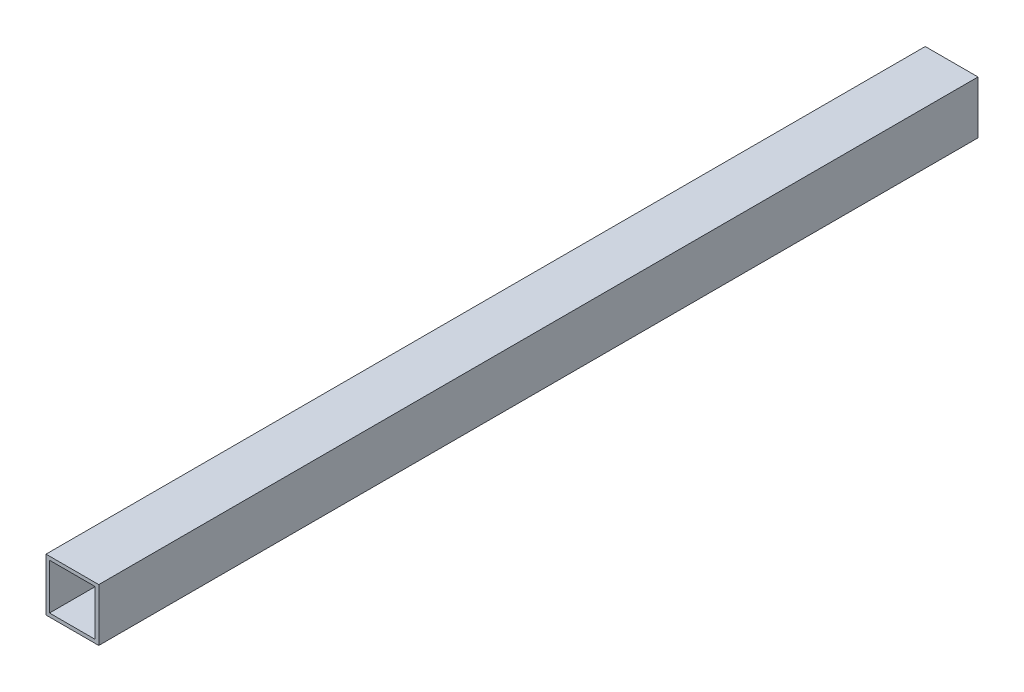
ISO-10303-21;
HEADER;
FILE_DESCRIPTION(('STEP AP214'),'2;1');
FILE_NAME('part.step','',(''),(''),'','','');
FILE_SCHEMA(('AUTOMOTIVE_DESIGN { 1 0 10303 214 1 1 1 1 }'));
ENDSEC;
DATA;
#1=APPLICATION_CONTEXT('core data for automotive mechanical design processes');
#2=APPLICATION_PROTOCOL_DEFINITION('international standard','automotive_design',2000,#1);
#3=PRODUCT_CONTEXT('',#1,'mechanical');
#4=PRODUCT('Part','Part','',(#3));
#5=PRODUCT_RELATED_PRODUCT_CATEGORY('part','',(#4));
#6=PRODUCT_DEFINITION_FORMATION('','',#4);
#7=PRODUCT_DEFINITION_CONTEXT('part definition',#1,'design');
#8=PRODUCT_DEFINITION('design','',#6,#7);
#9=PRODUCT_DEFINITION_SHAPE('','',#8);
#10=(LENGTH_UNIT() NAMED_UNIT(*) SI_UNIT(.MILLI.,.METRE.));
#11=(NAMED_UNIT(*) PLANE_ANGLE_UNIT() SI_UNIT($,.RADIAN.));
#12=(NAMED_UNIT(*) SI_UNIT($,.STERADIAN.) SOLID_ANGLE_UNIT());
#13=UNCERTAINTY_MEASURE_WITH_UNIT(LENGTH_MEASURE(1.E-05),#10,'distance_accuracy_value','');
#14=(GEOMETRIC_REPRESENTATION_CONTEXT(3) GLOBAL_UNCERTAINTY_ASSIGNED_CONTEXT((#13)) GLOBAL_UNIT_ASSIGNED_CONTEXT((#10,
#11,#12)) REPRESENTATION_CONTEXT('',''));
#15=CARTESIAN_POINT('',(0.,0.,0.));
#16=DIRECTION('',(0.,0.,1.));
#17=DIRECTION('',(1.,0.,0.));
#18=AXIS2_PLACEMENT_3D('',#15,#16,#17);
#19=CARTESIAN_POINT('',(0.,0.,250.));
#20=DIRECTION('',(0.,0.,1.));
#21=DIRECTION('',(1.,0.,0.));
#22=AXIS2_PLACEMENT_3D('',#19,#20,#21);
#23=PLANE('',#22);
#24=DIRECTION('',(0.,-1.,0.));
#25=VECTOR('',#24,1.);
#26=CARTESIAN_POINT('',(0.,0.,250.));
#27=LINE('',#26,#25);
#28=CARTESIAN_POINT('',(0.,15.,250.));
#29=VERTEX_POINT('',#28);
#30=CARTESIAN_POINT('',(0.,0.,250.));
#31=VERTEX_POINT('',#30);
#32=EDGE_CURVE('E164',#29,#31,#27,.T.);
#33=ORIENTED_EDGE('',*,*,#32,.T.);
#34=DIRECTION('',(1.,0.,0.));
#35=VECTOR('',#34,1.);
#36=CARTESIAN_POINT('',(0.,0.,250.));
#37=LINE('',#36,#35);
#38=CARTESIAN_POINT('',(15.,0.,250.));
#39=VERTEX_POINT('',#38);
#40=EDGE_CURVE('E167',#31,#39,#37,.T.);
#41=ORIENTED_EDGE('',*,*,#40,.T.);
#42=DIRECTION('',(0.,1.,0.));
#43=VECTOR('',#42,1.);
#44=CARTESIAN_POINT('',(15.,0.,250.));
#45=LINE('',#44,#43);
#46=CARTESIAN_POINT('',(15.,15.,250.));
#47=VERTEX_POINT('',#46);
#48=EDGE_CURVE('E170',#39,#47,#45,.T.);
#49=ORIENTED_EDGE('',*,*,#48,.T.);
#50=DIRECTION('',(-1.,0.,0.));
#51=VECTOR('',#50,1.);
#52=CARTESIAN_POINT('',(0.,15.,250.));
#53=LINE('',#52,#51);
#54=EDGE_CURVE('E172',#47,#29,#53,.T.);
#55=ORIENTED_EDGE('',*,*,#54,.T.);
#56=EDGE_LOOP('',(#33,#41,#49,#55));
#57=FACE_BOUND('',#56,.T.);
#58=DIRECTION('',(1.,0.,0.));
#59=VECTOR('',#58,1.);
#60=CARTESIAN_POINT('',(0.,1.,250.));
#61=LINE('',#60,#59);
#62=CARTESIAN_POINT('',(1.,1.,250.));
#63=VERTEX_POINT('',#62);
#64=CARTESIAN_POINT('',(14.,1.,250.));
#65=VERTEX_POINT('',#64);
#66=EDGE_CURVE('E136',#63,#65,#61,.T.);
#67=ORIENTED_EDGE('',*,*,#66,.F.);
#68=DIRECTION('',(0.,-1.,0.));
#69=VECTOR('',#68,1.);
#70=CARTESIAN_POINT('',(1.,0.,250.));
#71=LINE('',#70,#69);
#72=CARTESIAN_POINT('',(0.999999999999998,14.,250.));
#73=VERTEX_POINT('',#72);
#74=EDGE_CURVE('E128',#73,#63,#71,.T.);
#75=ORIENTED_EDGE('',*,*,#74,.F.);
#76=DIRECTION('',(-1.,0.,0.));
#77=VECTOR('',#76,1.);
#78=CARTESIAN_POINT('',(0.,14.,250.));
#79=LINE('',#78,#77);
#80=CARTESIAN_POINT('',(14.,14.,250.));
#81=VERTEX_POINT('',#80);
#82=EDGE_CURVE('E150',#81,#73,#79,.T.);
#83=ORIENTED_EDGE('',*,*,#82,.F.);
#84=DIRECTION('',(0.,1.,0.));
#85=VECTOR('',#84,1.);
#86=CARTESIAN_POINT('',(14.,0.,250.));
#87=LINE('',#86,#85);
#88=EDGE_CURVE('E148',#65,#81,#87,.T.);
#89=ORIENTED_EDGE('',*,*,#88,.F.);
#90=EDGE_LOOP('',(#67,#75,#83,#89));
#91=FACE_BOUND('',#90,.T.);
#92=ADVANCED_FACE('F63',(#57,#91),#23,.T.);
#93=CARTESIAN_POINT('',(0.,0.,0.));
#94=DIRECTION('',(0.,0.,1.));
#95=DIRECTION('',(1.,0.,0.));
#96=AXIS2_PLACEMENT_3D('',#93,#94,#95);
#97=PLANE('',#96);
#98=DIRECTION('',(0.,-1.,0.));
#99=VECTOR('',#98,1.);
#100=CARTESIAN_POINT('',(0.,0.,0.));
#101=LINE('',#100,#99);
#102=CARTESIAN_POINT('',(0.,15.,0.));
#103=VERTEX_POINT('',#102);
#104=CARTESIAN_POINT('',(0.,0.,0.));
#105=VERTEX_POINT('',#104);
#106=EDGE_CURVE('E144',#103,#105,#101,.T.);
#107=ORIENTED_EDGE('',*,*,#106,.F.);
#108=DIRECTION('',(-1.,0.,0.));
#109=VECTOR('',#108,1.);
#110=CARTESIAN_POINT('',(0.,15.,0.));
#111=LINE('',#110,#109);
#112=CARTESIAN_POINT('',(15.,15.,0.));
#113=VERTEX_POINT('',#112);
#114=EDGE_CURVE('E168',#113,#103,#111,.T.);
#115=ORIENTED_EDGE('',*,*,#114,.F.);
#116=DIRECTION('',(0.,1.,0.));
#117=VECTOR('',#116,1.);
#118=CARTESIAN_POINT('',(15.,0.,0.));
#119=LINE('',#118,#117);
#120=CARTESIAN_POINT('',(15.,0.,0.));
#121=VERTEX_POINT('',#120);
#122=EDGE_CURVE('E179',#121,#113,#119,.T.);
#123=ORIENTED_EDGE('',*,*,#122,.F.);
#124=DIRECTION('',(1.,0.,0.));
#125=VECTOR('',#124,1.);
#126=CARTESIAN_POINT('',(0.,0.,0.));
#127=LINE('',#126,#125);
#128=EDGE_CURVE('E177',#105,#121,#127,.T.);
#129=ORIENTED_EDGE('',*,*,#128,.F.);
#130=EDGE_LOOP('',(#107,#115,#123,#129));
#131=FACE_BOUND('',#130,.T.);
#132=DIRECTION('',(0.,-1.,0.));
#133=VECTOR('',#132,1.);
#134=CARTESIAN_POINT('',(1.,0.,0.));
#135=LINE('',#134,#133);
#136=CARTESIAN_POINT('',(0.999999999999998,14.,0.));
#137=VERTEX_POINT('',#136);
#138=CARTESIAN_POINT('',(1.,1.,0.));
#139=VERTEX_POINT('',#138);
#140=EDGE_CURVE('E86',#137,#139,#135,.T.);
#141=ORIENTED_EDGE('',*,*,#140,.T.);
#142=DIRECTION('',(1.,0.,0.));
#143=VECTOR('',#142,1.);
#144=CARTESIAN_POINT('',(0.,1.,0.));
#145=LINE('',#144,#143);
#146=CARTESIAN_POINT('',(14.,1.,0.));
#147=VERTEX_POINT('',#146);
#148=EDGE_CURVE('E143',#139,#147,#145,.T.);
#149=ORIENTED_EDGE('',*,*,#148,.T.);
#150=DIRECTION('',(0.,1.,0.));
#151=VECTOR('',#150,1.);
#152=CARTESIAN_POINT('',(14.,0.,0.));
#153=LINE('',#152,#151);
#154=CARTESIAN_POINT('',(14.,14.,0.));
#155=VERTEX_POINT('',#154);
#156=EDGE_CURVE('E156',#147,#155,#153,.T.);
#157=ORIENTED_EDGE('',*,*,#156,.T.);
#158=DIRECTION('',(-1.,0.,0.));
#159=VECTOR('',#158,1.);
#160=CARTESIAN_POINT('',(0.,14.,0.));
#161=LINE('',#160,#159);
#162=EDGE_CURVE('E137',#155,#137,#161,.T.);
#163=ORIENTED_EDGE('',*,*,#162,.T.);
#164=EDGE_LOOP('',(#141,#149,#157,#163));
#165=FACE_BOUND('',#164,.T.);
#166=ADVANCED_FACE('F197',(#131,#165),#97,.F.);
#167=CARTESIAN_POINT('',(0.,0.,250.));
#168=DIRECTION('',(1.,0.,0.));
#169=DIRECTION('',(0.,1.,0.));
#170=AXIS2_PLACEMENT_3D('',#167,#168,#169);
#171=PLANE('',#170);
#172=ORIENTED_EDGE('',*,*,#106,.T.);
#173=DIRECTION('',(0.,0.,-1.));
#174=VECTOR('',#173,1.);
#175=CARTESIAN_POINT('',(0.,0.,250.));
#176=LINE('',#175,#174);
#177=EDGE_CURVE('E12',#31,#105,#176,.T.);
#178=ORIENTED_EDGE('',*,*,#177,.F.);
#179=ORIENTED_EDGE('',*,*,#32,.F.);
#180=DIRECTION('',(0.,0.,-1.));
#181=VECTOR('',#180,1.);
#182=CARTESIAN_POINT('',(0.,15.,250.));
#183=LINE('',#182,#181);
#184=EDGE_CURVE('E174',#29,#103,#183,.T.);
#185=ORIENTED_EDGE('',*,*,#184,.T.);
#186=EDGE_LOOP('',(#172,#178,#179,#185));
#187=FACE_BOUND('',#186,.T.);
#188=ADVANCED_FACE('F65',(#187),#171,.F.);
#189=CARTESIAN_POINT('',(0.,0.,250.));
#190=DIRECTION('',(0.,1.,0.));
#191=DIRECTION('',(0.,0.,1.));
#192=AXIS2_PLACEMENT_3D('',#189,#190,#191);
#193=PLANE('',#192);
#194=ORIENTED_EDGE('',*,*,#128,.T.);
#195=DIRECTION('',(0.,0.,-1.));
#196=VECTOR('',#195,1.);
#197=CARTESIAN_POINT('',(15.,0.,250.));
#198=LINE('',#197,#196);
#199=EDGE_CURVE('E71',#39,#121,#198,.T.);
#200=ORIENTED_EDGE('',*,*,#199,.F.);
#201=ORIENTED_EDGE('',*,*,#40,.F.);
#202=ORIENTED_EDGE('',*,*,#177,.T.);
#203=EDGE_LOOP('',(#194,#200,#201,#202));
#204=FACE_BOUND('',#203,.T.);
#205=ADVANCED_FACE('F207',(#204),#193,.F.);
#206=CARTESIAN_POINT('',(15.,0.,250.));
#207=DIRECTION('',(-1.,0.,0.));
#208=DIRECTION('',(0.,-1.,0.));
#209=AXIS2_PLACEMENT_3D('',#206,#207,#208);
#210=PLANE('',#209);
#211=ORIENTED_EDGE('',*,*,#122,.T.);
#212=DIRECTION('',(0.,0.,-1.));
#213=VECTOR('',#212,1.);
#214=CARTESIAN_POINT('',(15.,15.,250.));
#215=LINE('',#214,#213);
#216=EDGE_CURVE('E184',#47,#113,#215,.T.);
#217=ORIENTED_EDGE('',*,*,#216,.F.);
#218=ORIENTED_EDGE('',*,*,#48,.F.);
#219=ORIENTED_EDGE('',*,*,#199,.T.);
#220=EDGE_LOOP('',(#211,#217,#218,#219));
#221=FACE_BOUND('',#220,.T.);
#222=ADVANCED_FACE('F191',(#221),#210,.F.);
#223=CARTESIAN_POINT('',(0.,15.,250.));
#224=DIRECTION('',(0.,-1.,0.));
#225=DIRECTION('',(0.,0.,-1.));
#226=AXIS2_PLACEMENT_3D('',#223,#224,#225);
#227=PLANE('',#226);
#228=ORIENTED_EDGE('',*,*,#114,.T.);
#229=ORIENTED_EDGE('',*,*,#184,.F.);
#230=ORIENTED_EDGE('',*,*,#54,.F.);
#231=ORIENTED_EDGE('',*,*,#216,.T.);
#232=EDGE_LOOP('',(#228,#229,#230,#231));
#233=FACE_BOUND('',#232,.T.);
#234=ADVANCED_FACE('F201',(#233),#227,.F.);
#235=CARTESIAN_POINT('',(1.,0.,250.));
#236=DIRECTION('',(1.,0.,0.));
#237=DIRECTION('',(0.,1.,0.));
#238=AXIS2_PLACEMENT_3D('',#235,#236,#237);
#239=PLANE('',#238);
#240=ORIENTED_EDGE('',*,*,#140,.F.);
#241=DIRECTION('',(0.,0.,-1.));
#242=VECTOR('',#241,1.);
#243=CARTESIAN_POINT('',(0.999999999999998,14.,250.));
#244=LINE('',#243,#242);
#245=EDGE_CURVE('E132',#73,#137,#244,.T.);
#246=ORIENTED_EDGE('',*,*,#245,.F.);
#247=ORIENTED_EDGE('',*,*,#74,.T.);
#248=DIRECTION('',(0.,0.,-1.));
#249=VECTOR('',#248,1.);
#250=CARTESIAN_POINT('',(1.,1.,250.));
#251=LINE('',#250,#249);
#252=EDGE_CURVE('E131',#63,#139,#251,.T.);
#253=ORIENTED_EDGE('',*,*,#252,.T.);
#254=EDGE_LOOP('',(#240,#246,#247,#253));
#255=FACE_BOUND('',#254,.T.);
#256=ADVANCED_FACE('F130',(#255),#239,.T.);
#257=CARTESIAN_POINT('',(0.,1.,250.));
#258=DIRECTION('',(0.,1.,0.));
#259=DIRECTION('',(0.,0.,1.));
#260=AXIS2_PLACEMENT_3D('',#257,#258,#259);
#261=PLANE('',#260);
#262=ORIENTED_EDGE('',*,*,#148,.F.);
#263=ORIENTED_EDGE('',*,*,#252,.F.);
#264=ORIENTED_EDGE('',*,*,#66,.T.);
#265=DIRECTION('',(0.,0.,-1.));
#266=VECTOR('',#265,1.);
#267=CARTESIAN_POINT('',(14.,1.,250.));
#268=LINE('',#267,#266);
#269=EDGE_CURVE('E145',#65,#147,#268,.T.);
#270=ORIENTED_EDGE('',*,*,#269,.T.);
#271=EDGE_LOOP('',(#262,#263,#264,#270));
#272=FACE_BOUND('',#271,.T.);
#273=ADVANCED_FACE('F140',(#272),#261,.T.);
#274=CARTESIAN_POINT('',(14.,0.,250.));
#275=DIRECTION('',(-1.,0.,0.));
#276=DIRECTION('',(0.,-1.,0.));
#277=AXIS2_PLACEMENT_3D('',#274,#275,#276);
#278=PLANE('',#277);
#279=ORIENTED_EDGE('',*,*,#156,.F.);
#280=ORIENTED_EDGE('',*,*,#269,.F.);
#281=ORIENTED_EDGE('',*,*,#88,.T.);
#282=DIRECTION('',(0.,0.,-1.));
#283=VECTOR('',#282,1.);
#284=CARTESIAN_POINT('',(14.,14.,250.));
#285=LINE('',#284,#283);
#286=EDGE_CURVE('E78',#81,#155,#285,.T.);
#287=ORIENTED_EDGE('',*,*,#286,.T.);
#288=EDGE_LOOP('',(#279,#280,#281,#287));
#289=FACE_BOUND('',#288,.T.);
#290=ADVANCED_FACE('F230',(#289),#278,.T.);
#291=CARTESIAN_POINT('',(0.,14.,250.));
#292=DIRECTION('',(0.,-1.,0.));
#293=DIRECTION('',(0.,0.,-1.));
#294=AXIS2_PLACEMENT_3D('',#291,#292,#293);
#295=PLANE('',#294);
#296=ORIENTED_EDGE('',*,*,#162,.F.);
#297=ORIENTED_EDGE('',*,*,#286,.F.);
#298=ORIENTED_EDGE('',*,*,#82,.T.);
#299=ORIENTED_EDGE('',*,*,#245,.T.);
#300=EDGE_LOOP('',(#296,#297,#298,#299));
#301=FACE_BOUND('',#300,.T.);
#302=ADVANCED_FACE('F234',(#301),#295,.T.);
#303=CLOSED_SHELL('',(#92,#166,#188,#205,#222,#234,#256,#273,#290,#302));
#304=MANIFOLD_SOLID_BREP('B2',#303);
#305=ADVANCED_BREP_SHAPE_REPRESENTATION('',(#18,#304),#14);
#306=SHAPE_DEFINITION_REPRESENTATION(#9,#305);
ENDSEC;
END-ISO-10303-21;
